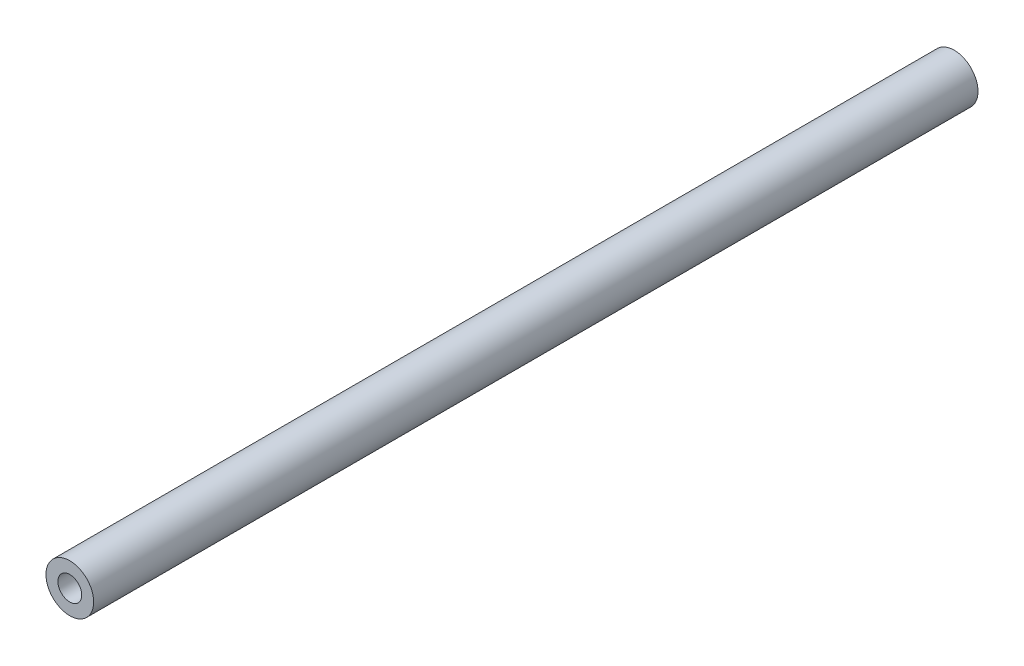
ISO-10303-21;
HEADER;
FILE_DESCRIPTION(('STEP AP214'),'2;1');
FILE_NAME('part.step','',(''),(''),'','','');
FILE_SCHEMA(('AUTOMOTIVE_DESIGN { 1 0 10303 214 1 1 1 1 }'));
ENDSEC;
DATA;
#1=APPLICATION_CONTEXT('core data for automotive mechanical design processes');
#2=APPLICATION_PROTOCOL_DEFINITION('international standard','automotive_design',2000,#1);
#3=PRODUCT_CONTEXT('',#1,'mechanical');
#4=PRODUCT('Part','Part','',(#3));
#5=PRODUCT_RELATED_PRODUCT_CATEGORY('part','',(#4));
#6=PRODUCT_DEFINITION_FORMATION('','',#4);
#7=PRODUCT_DEFINITION_CONTEXT('part definition',#1,'design');
#8=PRODUCT_DEFINITION('design','',#6,#7);
#9=PRODUCT_DEFINITION_SHAPE('','',#8);
#10=(LENGTH_UNIT() NAMED_UNIT(*) SI_UNIT(.MILLI.,.METRE.));
#11=(NAMED_UNIT(*) PLANE_ANGLE_UNIT() SI_UNIT($,.RADIAN.));
#12=(NAMED_UNIT(*) SI_UNIT($,.STERADIAN.) SOLID_ANGLE_UNIT());
#13=UNCERTAINTY_MEASURE_WITH_UNIT(LENGTH_MEASURE(1.E-05),#10,'distance_accuracy_value','');
#14=(GEOMETRIC_REPRESENTATION_CONTEXT(3) GLOBAL_UNCERTAINTY_ASSIGNED_CONTEXT((#13)) GLOBAL_UNIT_ASSIGNED_CONTEXT((#10,
#11,#12)) REPRESENTATION_CONTEXT('',''));
#15=CARTESIAN_POINT('',(0.,0.,0.));
#16=DIRECTION('',(0.,0.,1.));
#17=DIRECTION('',(1.,0.,0.));
#18=AXIS2_PLACEMENT_3D('',#15,#16,#17);
#19=CARTESIAN_POINT('',(0.,0.,-46.35));
#20=DIRECTION('',(0.,0.,1.));
#21=DIRECTION('',(1.,0.,0.));
#22=AXIS2_PLACEMENT_3D('',#19,#20,#21);
#23=PLANE('',#22);
#24=CARTESIAN_POINT('',(0.,0.,-46.35));
#25=DIRECTION('',(0.,0.,1.));
#26=DIRECTION('',(1.,0.,0.));
#27=AXIS2_PLACEMENT_3D('',#24,#25,#26);
#28=CIRCLE('',#27,2.5);
#29=CARTESIAN_POINT('',(2.5,0.,-46.35));
#30=VERTEX_POINT('',#29);
#31=EDGE_CURVE('E41',#30,#30,#28,.T.);
#32=ORIENTED_EDGE('',*,*,#31,.F.);
#33=EDGE_LOOP('',(#32));
#34=FACE_BOUND('',#33,.T.);
#35=CARTESIAN_POINT('',(0.,0.,-46.35));
#36=DIRECTION('',(0.,0.,-1.));
#37=DIRECTION('',(-1.,0.,0.));
#38=AXIS2_PLACEMENT_3D('',#35,#36,#37);
#39=CIRCLE('',#38,1.25);
#40=CARTESIAN_POINT('',(-1.25,0.,-46.35));
#41=VERTEX_POINT('',#40);
#42=EDGE_CURVE('E61',#41,#41,#39,.T.);
#43=ORIENTED_EDGE('',*,*,#42,.F.);
#44=EDGE_LOOP('',(#43));
#45=FACE_BOUND('',#44,.T.);
#46=ADVANCED_FACE('F37',(#34,#45),#23,.F.);
#47=CARTESIAN_POINT('',(0.,0.,46.35));
#48=DIRECTION('',(0.,0.,-1.));
#49=DIRECTION('',(-1.,0.,0.));
#50=AXIS2_PLACEMENT_3D('',#47,#48,#49);
#51=CYLINDRICAL_SURFACE('',#50,2.5);
#52=CARTESIAN_POINT('',(0.,0.,46.35));
#53=DIRECTION('',(0.,0.,1.));
#54=DIRECTION('',(1.,0.,0.));
#55=AXIS2_PLACEMENT_3D('',#52,#53,#54);
#56=CIRCLE('',#55,2.5);
#57=CARTESIAN_POINT('',(2.5,0.,46.35));
#58=VERTEX_POINT('',#57);
#59=EDGE_CURVE('E11',#58,#58,#56,.T.);
#60=ORIENTED_EDGE('',*,*,#59,.F.);
#61=EDGE_LOOP('',(#60));
#62=FACE_BOUND('',#61,.T.);
#63=ORIENTED_EDGE('',*,*,#31,.T.);
#64=EDGE_LOOP('',(#63));
#65=FACE_BOUND('',#64,.T.);
#66=ADVANCED_FACE('F39',(#62,#65),#51,.T.);
#67=CARTESIAN_POINT('',(0.,0.,46.35));
#68=DIRECTION('',(0.,0.,1.));
#69=DIRECTION('',(1.,0.,0.));
#70=AXIS2_PLACEMENT_3D('',#67,#68,#69);
#71=PLANE('',#70);
#72=CARTESIAN_POINT('',(0.,0.,46.35));
#73=DIRECTION('',(0.,0.,1.));
#74=DIRECTION('',(1.,0.,0.));
#75=AXIS2_PLACEMENT_3D('',#72,#73,#74);
#76=CIRCLE('',#75,1.25);
#77=CARTESIAN_POINT('',(1.25,0.,46.35));
#78=VERTEX_POINT('',#77);
#79=EDGE_CURVE('E62',#78,#78,#76,.T.);
#80=ORIENTED_EDGE('',*,*,#79,.F.);
#81=EDGE_LOOP('',(#80));
#82=FACE_BOUND('',#81,.T.);
#83=ORIENTED_EDGE('',*,*,#59,.T.);
#84=EDGE_LOOP('',(#83));
#85=FACE_BOUND('',#84,.T.);
#86=ADVANCED_FACE('F88',(#82,#85),#71,.T.);
#87=CARTESIAN_POINT('',(0.,0.,-37.85));
#88=DIRECTION('',(0.,0.,-1.));
#89=DIRECTION('',(-1.,0.,0.));
#90=AXIS2_PLACEMENT_3D('',#87,#88,#89);
#91=CONICAL_SURFACE('',#90,1.25,1.02974425867665);
#92=CARTESIAN_POINT('',(0.,0.,-37.0989242262156));
#93=VERTEX_POINT('',#92);
#94=VERTEX_LOOP('',#93);
#95=FACE_BOUND('',#94,.T.);
#96=CARTESIAN_POINT('',(0.,0.,-37.85));
#97=DIRECTION('',(0.,0.,-1.));
#98=DIRECTION('',(-1.,0.,0.));
#99=AXIS2_PLACEMENT_3D('',#96,#97,#98);
#100=CIRCLE('',#99,1.25);
#101=CARTESIAN_POINT('',(-1.25,0.,-37.85));
#102=VERTEX_POINT('',#101);
#103=EDGE_CURVE('E65',#102,#102,#100,.T.);
#104=ORIENTED_EDGE('',*,*,#103,.T.);
#105=EDGE_LOOP('',(#104));
#106=FACE_BOUND('',#105,.T.);
#107=ADVANCED_FACE('F82',(#95,#106),#91,.F.);
#108=CARTESIAN_POINT('',(0.,0.,-46.35));
#109=DIRECTION('',(0.,0.,-1.));
#110=DIRECTION('',(-1.,0.,0.));
#111=AXIS2_PLACEMENT_3D('',#108,#109,#110);
#112=CYLINDRICAL_SURFACE('',#111,1.25);
#113=ORIENTED_EDGE('',*,*,#103,.F.);
#114=EDGE_LOOP('',(#113));
#115=FACE_BOUND('',#114,.T.);
#116=ORIENTED_EDGE('',*,*,#42,.T.);
#117=EDGE_LOOP('',(#116));
#118=FACE_BOUND('',#117,.T.);
#119=ADVANCED_FACE('F55',(#115,#118),#112,.F.);
#120=CARTESIAN_POINT('',(0.,0.,37.85));
#121=DIRECTION('',(0.,0.,1.));
#122=DIRECTION('',(1.,0.,0.));
#123=AXIS2_PLACEMENT_3D('',#120,#121,#122);
#124=CONICAL_SURFACE('',#123,1.25,1.02974425867665);
#125=CARTESIAN_POINT('',(0.,0.,37.0989242262156));
#126=VERTEX_POINT('',#125);
#127=VERTEX_LOOP('',#126);
#128=FACE_BOUND('',#127,.T.);
#129=CARTESIAN_POINT('',(0.,0.,37.85));
#130=DIRECTION('',(0.,0.,1.));
#131=DIRECTION('',(1.,0.,0.));
#132=AXIS2_PLACEMENT_3D('',#129,#130,#131);
#133=CIRCLE('',#132,1.25);
#134=CARTESIAN_POINT('',(1.25,0.,37.85));
#135=VERTEX_POINT('',#134);
#136=EDGE_CURVE('E59',#135,#135,#133,.T.);
#137=ORIENTED_EDGE('',*,*,#136,.T.);
#138=EDGE_LOOP('',(#137));
#139=FACE_BOUND('',#138,.T.);
#140=ADVANCED_FACE('F51',(#128,#139),#124,.F.);
#141=CARTESIAN_POINT('',(0.,0.,46.35));
#142=DIRECTION('',(0.,0.,1.));
#143=DIRECTION('',(1.,0.,0.));
#144=AXIS2_PLACEMENT_3D('',#141,#142,#143);
#145=CYLINDRICAL_SURFACE('',#144,1.25);
#146=ORIENTED_EDGE('',*,*,#136,.F.);
#147=EDGE_LOOP('',(#146));
#148=FACE_BOUND('',#147,.T.);
#149=ORIENTED_EDGE('',*,*,#79,.T.);
#150=EDGE_LOOP('',(#149));
#151=FACE_BOUND('',#150,.T.);
#152=ADVANCED_FACE('F54',(#148,#151),#145,.F.);
#153=CLOSED_SHELL('',(#46,#66,#86,#107,#119,#140,#152));
#154=MANIFOLD_SOLID_BREP('B2',#153);
#155=ADVANCED_BREP_SHAPE_REPRESENTATION('',(#18,#154),#14);
#156=SHAPE_DEFINITION_REPRESENTATION(#9,#155);
ENDSEC;
END-ISO-10303-21;
